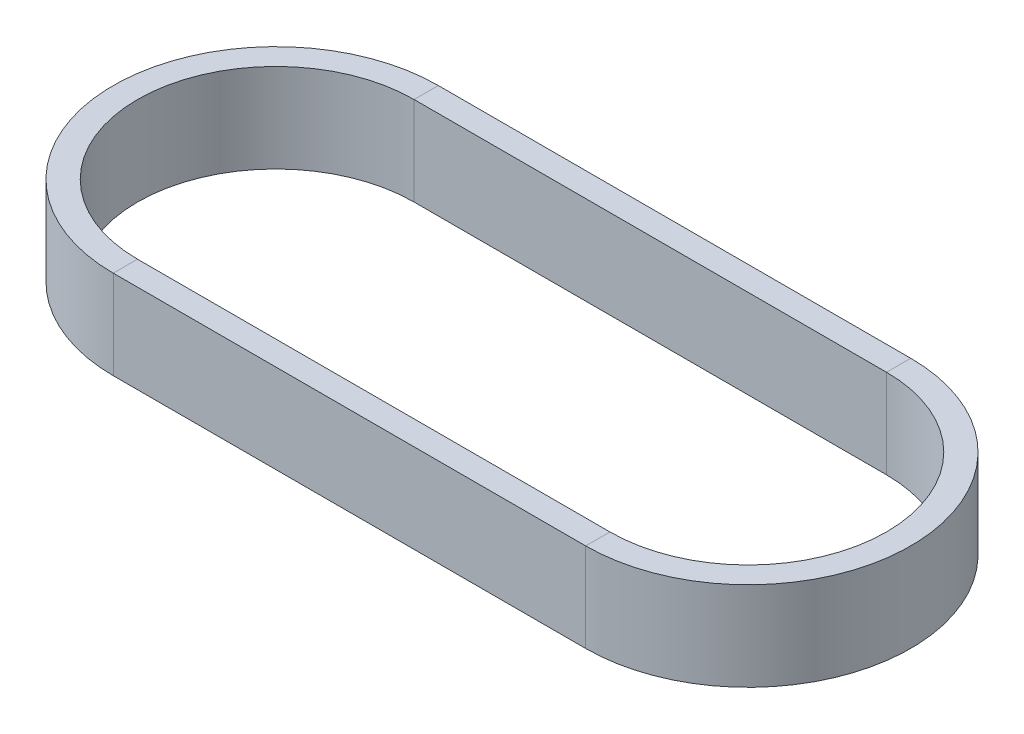
ISO-10303-21;
HEADER;
FILE_DESCRIPTION(('STEP AP214'),'2;1');
FILE_NAME('part.step','',(''),(''),'','','');
FILE_SCHEMA(('AUTOMOTIVE_DESIGN { 1 0 10303 214 1 1 1 1 }'));
ENDSEC;
DATA;
#1=APPLICATION_CONTEXT('core data for automotive mechanical design processes');
#2=APPLICATION_PROTOCOL_DEFINITION('international standard','automotive_design',2000,#1);
#3=PRODUCT_CONTEXT('',#1,'mechanical');
#4=PRODUCT('Part','Part','',(#3));
#5=PRODUCT_RELATED_PRODUCT_CATEGORY('part','',(#4));
#6=PRODUCT_DEFINITION_FORMATION('','',#4);
#7=PRODUCT_DEFINITION_CONTEXT('part definition',#1,'design');
#8=PRODUCT_DEFINITION('design','',#6,#7);
#9=PRODUCT_DEFINITION_SHAPE('','',#8);
#10=(LENGTH_UNIT() NAMED_UNIT(*) SI_UNIT(.MILLI.,.METRE.));
#11=(NAMED_UNIT(*) PLANE_ANGLE_UNIT() SI_UNIT($,.RADIAN.));
#12=(NAMED_UNIT(*) SI_UNIT($,.STERADIAN.) SOLID_ANGLE_UNIT());
#13=UNCERTAINTY_MEASURE_WITH_UNIT(LENGTH_MEASURE(1.E-05),#10,'distance_accuracy_value','');
#14=(GEOMETRIC_REPRESENTATION_CONTEXT(3) GLOBAL_UNCERTAINTY_ASSIGNED_CONTEXT((#13)) GLOBAL_UNIT_ASSIGNED_CONTEXT((#10,
#11,#12)) REPRESENTATION_CONTEXT('',''));
#15=CARTESIAN_POINT('',(0.,0.,0.));
#16=DIRECTION('',(0.,0.,1.));
#17=DIRECTION('',(1.,0.,0.));
#18=AXIS2_PLACEMENT_3D('',#15,#16,#17);
#19=CARTESIAN_POINT('',(0.,11.,34.2489));
#20=DIRECTION('',(0.,1.,0.));
#21=DIRECTION('',(0.,0.,1.));
#22=AXIS2_PLACEMENT_3D('',#19,#20,#21);
#23=PLANE('',#22);
#24=DIRECTION('',(-1.,0.,0.));
#25=VECTOR('',#24,1.);
#26=CARTESIAN_POINT('',(0.,11.,40.2489));
#27=LINE('',#26,#25);
#28=CARTESIAN_POINT('',(0.,11.,40.2489));
#29=VERTEX_POINT('',#28);
#30=CARTESIAN_POINT('',(-117.00557942,11.,40.2489));
#31=VERTEX_POINT('',#30);
#32=EDGE_CURVE('E11',#29,#31,#27,.T.);
#33=ORIENTED_EDGE('',*,*,#32,.F.);
#34=DIRECTION('',(0.,0.,-1.));
#35=VECTOR('',#34,1.);
#36=CARTESIAN_POINT('',(0.,11.,34.2489));
#37=LINE('',#36,#35);
#38=CARTESIAN_POINT('',(0.,11.,34.2489));
#39=VERTEX_POINT('',#38);
#40=EDGE_CURVE('E42',#29,#39,#37,.T.);
#41=ORIENTED_EDGE('',*,*,#40,.T.);
#42=DIRECTION('',(-1.,0.,0.));
#43=VECTOR('',#42,1.);
#44=CARTESIAN_POINT('',(0.,11.,34.2489));
#45=LINE('',#44,#43);
#46=CARTESIAN_POINT('',(-117.00557942,11.,34.2489));
#47=VERTEX_POINT('',#46);
#48=EDGE_CURVE('E128',#39,#47,#45,.T.);
#49=ORIENTED_EDGE('',*,*,#48,.T.);
#50=DIRECTION('',(0.,0.,-1.));
#51=VECTOR('',#50,1.);
#52=CARTESIAN_POINT('',(-117.00557942,11.,34.2489));
#53=LINE('',#52,#51);
#54=EDGE_CURVE('E131',#31,#47,#53,.T.);
#55=ORIENTED_EDGE('',*,*,#54,.F.);
#56=EDGE_LOOP('',(#33,#41,#49,#55));
#57=FACE_BOUND('',#56,.T.);
#58=ADVANCED_FACE('F39',(#57),#23,.T.);
#59=CARTESIAN_POINT('',(0.,11.,40.2489));
#60=DIRECTION('',(0.,0.,1.));
#61=DIRECTION('',(1.,0.,0.));
#62=AXIS2_PLACEMENT_3D('',#59,#60,#61);
#63=PLANE('',#62);
#64=DIRECTION('',(-1.,0.,0.));
#65=VECTOR('',#64,1.);
#66=CARTESIAN_POINT('',(0.,-11.,40.2489));
#67=LINE('',#66,#65);
#68=CARTESIAN_POINT('',(0.,-11.,40.2489));
#69=VERTEX_POINT('',#68);
#70=CARTESIAN_POINT('',(-117.00557942,-11.,40.2489));
#71=VERTEX_POINT('',#70);
#72=EDGE_CURVE('E48',#69,#71,#67,.T.);
#73=ORIENTED_EDGE('',*,*,#72,.F.);
#74=DIRECTION('',(0.,1.,0.));
#75=VECTOR('',#74,1.);
#76=CARTESIAN_POINT('',(0.,11.,40.2489));
#77=LINE('',#76,#75);
#78=EDGE_CURVE('E218',#69,#29,#77,.T.);
#79=ORIENTED_EDGE('',*,*,#78,.T.);
#80=ORIENTED_EDGE('',*,*,#32,.T.);
#81=DIRECTION('',(0.,1.,0.));
#82=VECTOR('',#81,1.);
#83=CARTESIAN_POINT('',(-117.00557942,11.,40.2489));
#84=LINE('',#83,#82);
#85=EDGE_CURVE('E159',#71,#31,#84,.T.);
#86=ORIENTED_EDGE('',*,*,#85,.F.);
#87=EDGE_LOOP('',(#73,#79,#80,#86));
#88=FACE_BOUND('',#87,.T.);
#89=ADVANCED_FACE('F252',(#88),#63,.T.);
#90=CARTESIAN_POINT('',(0.,-11.,34.2489));
#91=DIRECTION('',(0.,-1.,0.));
#92=DIRECTION('',(0.,0.,-1.));
#93=AXIS2_PLACEMENT_3D('',#90,#91,#92);
#94=PLANE('',#93);
#95=DIRECTION('',(-1.,0.,0.));
#96=VECTOR('',#95,1.);
#97=CARTESIAN_POINT('',(0.,-11.,34.2489));
#98=LINE('',#97,#96);
#99=CARTESIAN_POINT('',(0.,-11.,34.2489));
#100=VERTEX_POINT('',#99);
#101=CARTESIAN_POINT('',(-117.00557942,-11.,34.2489));
#102=VERTEX_POINT('',#101);
#103=EDGE_CURVE('E138',#100,#102,#98,.T.);
#104=ORIENTED_EDGE('',*,*,#103,.F.);
#105=DIRECTION('',(0.,0.,1.));
#106=VECTOR('',#105,1.);
#107=CARTESIAN_POINT('',(0.,-11.,34.2489));
#108=LINE('',#107,#106);
#109=EDGE_CURVE('E194',#100,#69,#108,.T.);
#110=ORIENTED_EDGE('',*,*,#109,.T.);
#111=ORIENTED_EDGE('',*,*,#72,.T.);
#112=DIRECTION('',(0.,0.,1.));
#113=VECTOR('',#112,1.);
#114=CARTESIAN_POINT('',(-117.00557942,-11.,34.2489));
#115=LINE('',#114,#113);
#116=EDGE_CURVE('E164',#102,#71,#115,.T.);
#117=ORIENTED_EDGE('',*,*,#116,.F.);
#118=EDGE_LOOP('',(#104,#110,#111,#117));
#119=FACE_BOUND('',#118,.T.);
#120=ADVANCED_FACE('F257',(#119),#94,.T.);
#121=CARTESIAN_POINT('',(0.,11.,-34.2489));
#122=DIRECTION('',(0.,1.,0.));
#123=DIRECTION('',(0.,0.,1.));
#124=AXIS2_PLACEMENT_3D('',#121,#122,#123);
#125=PLANE('',#124);
#126=ORIENTED_EDGE('',*,*,#40,.F.);
#127=CARTESIAN_POINT('',(0.,11.,0.));
#128=DIRECTION('',(0.,-1.,0.));
#129=DIRECTION('',(0.,0.,-1.));
#130=AXIS2_PLACEMENT_3D('',#127,#128,#129);
#131=CIRCLE('',#130,40.2489);
#132=CARTESIAN_POINT('',(0.,11.,-40.2489));
#133=VERTEX_POINT('',#132);
#134=EDGE_CURVE('E84',#133,#29,#131,.T.);
#135=ORIENTED_EDGE('',*,*,#134,.F.);
#136=DIRECTION('',(0.,0.,1.));
#137=VECTOR('',#136,1.);
#138=CARTESIAN_POINT('',(0.,11.,-34.2489));
#139=LINE('',#138,#137);
#140=CARTESIAN_POINT('',(0.,11.,-34.2489));
#141=VERTEX_POINT('',#140);
#142=EDGE_CURVE('E198',#133,#141,#139,.T.);
#143=ORIENTED_EDGE('',*,*,#142,.T.);
#144=CARTESIAN_POINT('',(0.,11.,0.));
#145=DIRECTION('',(0.,-1.,0.));
#146=DIRECTION('',(0.,0.,-1.));
#147=AXIS2_PLACEMENT_3D('',#144,#145,#146);
#148=CIRCLE('',#147,34.2489);
#149=EDGE_CURVE('E191',#141,#39,#148,.T.);
#150=ORIENTED_EDGE('',*,*,#149,.T.);
#151=EDGE_LOOP('',(#126,#135,#143,#150));
#152=FACE_BOUND('',#151,.T.);
#153=ADVANCED_FACE('F241',(#152),#125,.T.);
#154=CARTESIAN_POINT('',(0.,0.,0.));
#155=DIRECTION('',(0.,-1.,0.));
#156=DIRECTION('',(0.,0.,-1.));
#157=AXIS2_PLACEMENT_3D('',#154,#155,#156);
#158=CYLINDRICAL_SURFACE('',#157,40.2489);
#159=ORIENTED_EDGE('',*,*,#134,.T.);
#160=ORIENTED_EDGE('',*,*,#78,.F.);
#161=CARTESIAN_POINT('',(0.,-11.,0.));
#162=DIRECTION('',(0.,-1.,0.));
#163=DIRECTION('',(0.,0.,-1.));
#164=AXIS2_PLACEMENT_3D('',#161,#162,#163);
#165=CIRCLE('',#164,40.2489);
#166=CARTESIAN_POINT('',(0.,-11.,-40.2489));
#167=VERTEX_POINT('',#166);
#168=EDGE_CURVE('E93',#167,#69,#165,.T.);
#169=ORIENTED_EDGE('',*,*,#168,.F.);
#170=DIRECTION('',(0.,1.,0.));
#171=VECTOR('',#170,1.);
#172=CARTESIAN_POINT('',(0.,11.,-40.2489));
#173=LINE('',#172,#171);
#174=EDGE_CURVE('E212',#167,#133,#173,.T.);
#175=ORIENTED_EDGE('',*,*,#174,.T.);
#176=EDGE_LOOP('',(#159,#160,#169,#175));
#177=FACE_BOUND('',#176,.T.);
#178=ADVANCED_FACE('F251',(#177),#158,.T.);
#179=CARTESIAN_POINT('',(0.,-11.,-34.2489));
#180=DIRECTION('',(0.,-1.,0.));
#181=DIRECTION('',(0.,0.,-1.));
#182=AXIS2_PLACEMENT_3D('',#179,#180,#181);
#183=PLANE('',#182);
#184=ORIENTED_EDGE('',*,*,#168,.T.);
#185=ORIENTED_EDGE('',*,*,#109,.F.);
#186=CARTESIAN_POINT('',(0.,-11.,0.));
#187=DIRECTION('',(0.,-1.,0.));
#188=DIRECTION('',(0.,0.,-1.));
#189=AXIS2_PLACEMENT_3D('',#186,#187,#188);
#190=CIRCLE('',#189,34.2489);
#191=CARTESIAN_POINT('',(0.,-11.,-34.2489));
#192=VERTEX_POINT('',#191);
#193=EDGE_CURVE('E101',#192,#100,#190,.T.);
#194=ORIENTED_EDGE('',*,*,#193,.F.);
#195=DIRECTION('',(0.,0.,-1.));
#196=VECTOR('',#195,1.);
#197=CARTESIAN_POINT('',(0.,-11.,-34.2489));
#198=LINE('',#197,#196);
#199=EDGE_CURVE('E183',#192,#167,#198,.T.);
#200=ORIENTED_EDGE('',*,*,#199,.T.);
#201=EDGE_LOOP('',(#184,#185,#194,#200));
#202=FACE_BOUND('',#201,.T.);
#203=ADVANCED_FACE('F258',(#202),#183,.T.);
#204=CARTESIAN_POINT('',(0.,0.,0.));
#205=DIRECTION('',(0.,-1.,0.));
#206=DIRECTION('',(0.,0.,-1.));
#207=AXIS2_PLACEMENT_3D('',#204,#205,#206);
#208=CYLINDRICAL_SURFACE('',#207,34.2489);
#209=ORIENTED_EDGE('',*,*,#193,.T.);
#210=DIRECTION('',(0.,-1.,0.));
#211=VECTOR('',#210,1.);
#212=CARTESIAN_POINT('',(0.,11.,34.2489));
#213=LINE('',#212,#211);
#214=EDGE_CURVE('E188',#39,#100,#213,.T.);
#215=ORIENTED_EDGE('',*,*,#214,.F.);
#216=ORIENTED_EDGE('',*,*,#149,.F.);
#217=DIRECTION('',(0.,-1.,0.));
#218=VECTOR('',#217,1.);
#219=CARTESIAN_POINT('',(0.,11.,-34.2489));
#220=LINE('',#219,#218);
#221=EDGE_CURVE('E176',#141,#192,#220,.T.);
#222=ORIENTED_EDGE('',*,*,#221,.T.);
#223=EDGE_LOOP('',(#209,#215,#216,#222));
#224=FACE_BOUND('',#223,.T.);
#225=ADVANCED_FACE('F259',(#224),#208,.F.);
#226=CARTESIAN_POINT('',(-117.00557942,11.,-34.2489));
#227=DIRECTION('',(0.,1.,0.));
#228=DIRECTION('',(0.,0.,1.));
#229=AXIS2_PLACEMENT_3D('',#226,#227,#228);
#230=PLANE('',#229);
#231=ORIENTED_EDGE('',*,*,#142,.F.);
#232=DIRECTION('',(1.,0.,0.));
#233=VECTOR('',#232,1.);
#234=CARTESIAN_POINT('',(-117.00557942,11.,-40.2489));
#235=LINE('',#234,#233);
#236=CARTESIAN_POINT('',(-117.00557942,11.,-40.2489));
#237=VERTEX_POINT('',#236);
#238=EDGE_CURVE('E229',#237,#133,#235,.T.);
#239=ORIENTED_EDGE('',*,*,#238,.F.);
#240=DIRECTION('',(0.,0.,1.));
#241=VECTOR('',#240,1.);
#242=CARTESIAN_POINT('',(-117.00557942,11.,-34.2489));
#243=LINE('',#242,#241);
#244=CARTESIAN_POINT('',(-117.00557942,11.,-34.2489));
#245=VERTEX_POINT('',#244);
#246=EDGE_CURVE('E187',#237,#245,#243,.T.);
#247=ORIENTED_EDGE('',*,*,#246,.T.);
#248=DIRECTION('',(1.,0.,0.));
#249=VECTOR('',#248,1.);
#250=CARTESIAN_POINT('',(-117.00557942,11.,-34.2489));
#251=LINE('',#250,#249);
#252=EDGE_CURVE('E180',#245,#141,#251,.T.);
#253=ORIENTED_EDGE('',*,*,#252,.T.);
#254=EDGE_LOOP('',(#231,#239,#247,#253));
#255=FACE_BOUND('',#254,.T.);
#256=ADVANCED_FACE('F246',(#255),#230,.T.);
#257=CARTESIAN_POINT('',(-117.00557942,11.,-40.2489));
#258=DIRECTION('',(0.,0.,-1.));
#259=DIRECTION('',(-1.,0.,0.));
#260=AXIS2_PLACEMENT_3D('',#257,#258,#259);
#261=PLANE('',#260);
#262=ORIENTED_EDGE('',*,*,#238,.T.);
#263=ORIENTED_EDGE('',*,*,#174,.F.);
#264=DIRECTION('',(1.,0.,0.));
#265=VECTOR('',#264,1.);
#266=CARTESIAN_POINT('',(-117.00557942,-11.,-40.2489));
#267=LINE('',#266,#265);
#268=CARTESIAN_POINT('',(-117.00557942,-11.,-40.2489));
#269=VERTEX_POINT('',#268);
#270=EDGE_CURVE('E113',#269,#167,#267,.T.);
#271=ORIENTED_EDGE('',*,*,#270,.F.);
#272=DIRECTION('',(0.,1.,0.));
#273=VECTOR('',#272,1.);
#274=CARTESIAN_POINT('',(-117.00557942,11.,-40.2489));
#275=LINE('',#274,#273);
#276=EDGE_CURVE('E207',#269,#237,#275,.T.);
#277=ORIENTED_EDGE('',*,*,#276,.T.);
#278=EDGE_LOOP('',(#262,#263,#271,#277));
#279=FACE_BOUND('',#278,.T.);
#280=ADVANCED_FACE('F250',(#279),#261,.T.);
#281=CARTESIAN_POINT('',(-117.00557942,-11.,-34.2489));
#282=DIRECTION('',(0.,-1.,0.));
#283=DIRECTION('',(0.,0.,-1.));
#284=AXIS2_PLACEMENT_3D('',#281,#282,#283);
#285=PLANE('',#284);
#286=ORIENTED_EDGE('',*,*,#270,.T.);
#287=ORIENTED_EDGE('',*,*,#199,.F.);
#288=DIRECTION('',(1.,0.,0.));
#289=VECTOR('',#288,1.);
#290=CARTESIAN_POINT('',(-117.00557942,-11.,-34.2489));
#291=LINE('',#290,#289);
#292=CARTESIAN_POINT('',(-117.00557942,-11.,-34.2489));
#293=VERTEX_POINT('',#292);
#294=EDGE_CURVE('E119',#293,#192,#291,.T.);
#295=ORIENTED_EDGE('',*,*,#294,.F.);
#296=DIRECTION('',(0.,0.,-1.));
#297=VECTOR('',#296,1.);
#298=CARTESIAN_POINT('',(-117.00557942,-11.,-34.2489));
#299=LINE('',#298,#297);
#300=EDGE_CURVE('E174',#293,#269,#299,.T.);
#301=ORIENTED_EDGE('',*,*,#300,.T.);
#302=EDGE_LOOP('',(#286,#287,#295,#301));
#303=FACE_BOUND('',#302,.T.);
#304=ADVANCED_FACE('F312',(#303),#285,.T.);
#305=CARTESIAN_POINT('',(-117.00557942,11.,-34.2489));
#306=DIRECTION('',(0.,0.,1.));
#307=DIRECTION('',(0.,-1.,0.));
#308=AXIS2_PLACEMENT_3D('',#305,#306,#307);
#309=PLANE('',#308);
#310=ORIENTED_EDGE('',*,*,#294,.T.);
#311=ORIENTED_EDGE('',*,*,#221,.F.);
#312=ORIENTED_EDGE('',*,*,#252,.F.);
#313=DIRECTION('',(0.,-1.,0.));
#314=VECTOR('',#313,1.);
#315=CARTESIAN_POINT('',(-117.00557942,11.,-34.2489));
#316=LINE('',#315,#314);
#317=EDGE_CURVE('E149',#245,#293,#316,.T.);
#318=ORIENTED_EDGE('',*,*,#317,.T.);
#319=EDGE_LOOP('',(#310,#311,#312,#318));
#320=FACE_BOUND('',#319,.T.);
#321=ADVANCED_FACE('F244',(#320),#309,.T.);
#322=CARTESIAN_POINT('',(-117.00557942,11.,34.2489));
#323=DIRECTION('',(0.,1.,0.));
#324=DIRECTION('',(0.,0.,1.));
#325=AXIS2_PLACEMENT_3D('',#322,#323,#324);
#326=PLANE('',#325);
#327=ORIENTED_EDGE('',*,*,#246,.F.);
#328=CARTESIAN_POINT('',(-117.00557942,11.,0.));
#329=DIRECTION('',(0.,-1.,0.));
#330=DIRECTION('',(0.,0.,1.));
#331=AXIS2_PLACEMENT_3D('',#328,#329,#330);
#332=CIRCLE('',#331,40.2489);
#333=EDGE_CURVE('E157',#31,#237,#332,.T.);
#334=ORIENTED_EDGE('',*,*,#333,.F.);
#335=ORIENTED_EDGE('',*,*,#54,.T.);
#336=CARTESIAN_POINT('',(-117.00557942,11.,0.));
#337=DIRECTION('',(0.,-1.,0.));
#338=DIRECTION('',(0.,0.,1.));
#339=AXIS2_PLACEMENT_3D('',#336,#337,#338);
#340=CIRCLE('',#339,34.2489);
#341=EDGE_CURVE('E144',#47,#245,#340,.T.);
#342=ORIENTED_EDGE('',*,*,#341,.T.);
#343=EDGE_LOOP('',(#327,#334,#335,#342));
#344=FACE_BOUND('',#343,.T.);
#345=ADVANCED_FACE('F155',(#344),#326,.T.);
#346=CARTESIAN_POINT('',(-117.00557942,0.,0.));
#347=DIRECTION('',(0.,-1.,0.));
#348=DIRECTION('',(0.,0.,-1.));
#349=AXIS2_PLACEMENT_3D('',#346,#347,#348);
#350=CYLINDRICAL_SURFACE('',#349,40.2489);
#351=ORIENTED_EDGE('',*,*,#333,.T.);
#352=ORIENTED_EDGE('',*,*,#276,.F.);
#353=CARTESIAN_POINT('',(-117.00557942,-11.,0.));
#354=DIRECTION('',(0.,-1.,0.));
#355=DIRECTION('',(0.,0.,1.));
#356=AXIS2_PLACEMENT_3D('',#353,#354,#355);
#357=CIRCLE('',#356,40.2489);
#358=EDGE_CURVE('E203',#71,#269,#357,.T.);
#359=ORIENTED_EDGE('',*,*,#358,.F.);
#360=ORIENTED_EDGE('',*,*,#85,.T.);
#361=EDGE_LOOP('',(#351,#352,#359,#360));
#362=FACE_BOUND('',#361,.T.);
#363=ADVANCED_FACE('F248',(#362),#350,.T.);
#364=CARTESIAN_POINT('',(-117.00557942,-11.,34.2489));
#365=DIRECTION('',(0.,-1.,0.));
#366=DIRECTION('',(0.,0.,-1.));
#367=AXIS2_PLACEMENT_3D('',#364,#365,#366);
#368=PLANE('',#367);
#369=ORIENTED_EDGE('',*,*,#358,.T.);
#370=ORIENTED_EDGE('',*,*,#300,.F.);
#371=CARTESIAN_POINT('',(-117.00557942,-11.,0.));
#372=DIRECTION('',(0.,-1.,0.));
#373=DIRECTION('',(0.,0.,1.));
#374=AXIS2_PLACEMENT_3D('',#371,#372,#373);
#375=CIRCLE('',#374,34.2489);
#376=EDGE_CURVE('E172',#102,#293,#375,.T.);
#377=ORIENTED_EDGE('',*,*,#376,.F.);
#378=ORIENTED_EDGE('',*,*,#116,.T.);
#379=EDGE_LOOP('',(#369,#370,#377,#378));
#380=FACE_BOUND('',#379,.T.);
#381=ADVANCED_FACE('F255',(#380),#368,.T.);
#382=CARTESIAN_POINT('',(-117.00557942,0.,0.));
#383=DIRECTION('',(0.,-1.,0.));
#384=DIRECTION('',(0.,0.,-1.));
#385=AXIS2_PLACEMENT_3D('',#382,#383,#384);
#386=CYLINDRICAL_SURFACE('',#385,34.2489);
#387=ORIENTED_EDGE('',*,*,#376,.T.);
#388=ORIENTED_EDGE('',*,*,#317,.F.);
#389=ORIENTED_EDGE('',*,*,#341,.F.);
#390=DIRECTION('',(0.,-1.,0.));
#391=VECTOR('',#390,1.);
#392=CARTESIAN_POINT('',(-117.00557942,11.,34.2489));
#393=LINE('',#392,#391);
#394=EDGE_CURVE('E147',#47,#102,#393,.T.);
#395=ORIENTED_EDGE('',*,*,#394,.T.);
#396=EDGE_LOOP('',(#387,#388,#389,#395));
#397=FACE_BOUND('',#396,.T.);
#398=ADVANCED_FACE('F146',(#397),#386,.F.);
#399=CARTESIAN_POINT('',(0.,11.,34.2489));
#400=DIRECTION('',(0.,0.,-1.));
#401=DIRECTION('',(0.,1.,0.));
#402=AXIS2_PLACEMENT_3D('',#399,#400,#401);
#403=PLANE('',#402);
#404=ORIENTED_EDGE('',*,*,#214,.T.);
#405=ORIENTED_EDGE('',*,*,#103,.T.);
#406=ORIENTED_EDGE('',*,*,#394,.F.);
#407=ORIENTED_EDGE('',*,*,#48,.F.);
#408=EDGE_LOOP('',(#404,#405,#406,#407));
#409=FACE_BOUND('',#408,.T.);
#410=ADVANCED_FACE('F161',(#409),#403,.T.);
#411=CLOSED_SHELL('',(#58,#89,#120,#153,#178,#203,#225,#256,#280,#304,#321,#345,#363,#381,#398,#410));
#412=MANIFOLD_SOLID_BREP('B2',#411);
#413=ADVANCED_BREP_SHAPE_REPRESENTATION('',(#18,#412),#14);
#414=SHAPE_DEFINITION_REPRESENTATION(#9,#413);
ENDSEC;
END-ISO-10303-21;
